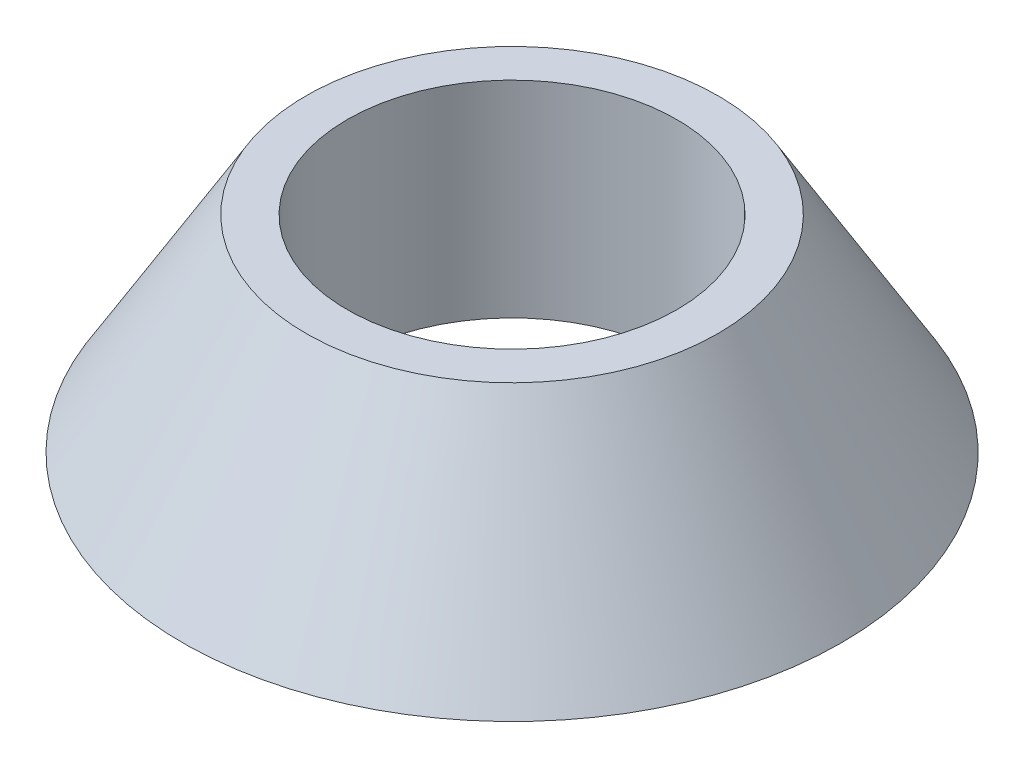
ISO-10303-21;
HEADER;
FILE_DESCRIPTION(('STEP AP214'),'2;1');
FILE_NAME('part.step','',(''),(''),'','','');
FILE_SCHEMA(('AUTOMOTIVE_DESIGN { 1 0 10303 214 1 1 1 1 }'));
ENDSEC;
DATA;
#1=APPLICATION_CONTEXT('core data for automotive mechanical design processes');
#2=APPLICATION_PROTOCOL_DEFINITION('international standard','automotive_design',2000,#1);
#3=PRODUCT_CONTEXT('',#1,'mechanical');
#4=PRODUCT('Part','Part','',(#3));
#5=PRODUCT_RELATED_PRODUCT_CATEGORY('part','',(#4));
#6=PRODUCT_DEFINITION_FORMATION('','',#4);
#7=PRODUCT_DEFINITION_CONTEXT('part definition',#1,'design');
#8=PRODUCT_DEFINITION('design','',#6,#7);
#9=PRODUCT_DEFINITION_SHAPE('','',#8);
#10=(LENGTH_UNIT() NAMED_UNIT(*) SI_UNIT(.MILLI.,.METRE.));
#11=(NAMED_UNIT(*) PLANE_ANGLE_UNIT() SI_UNIT($,.RADIAN.));
#12=(NAMED_UNIT(*) SI_UNIT($,.STERADIAN.) SOLID_ANGLE_UNIT());
#13=UNCERTAINTY_MEASURE_WITH_UNIT(LENGTH_MEASURE(1.E-05),#10,'distance_accuracy_value','');
#14=(GEOMETRIC_REPRESENTATION_CONTEXT(3) GLOBAL_UNCERTAINTY_ASSIGNED_CONTEXT((#13)) GLOBAL_UNIT_ASSIGNED_CONTEXT((#10,
#11,#12)) REPRESENTATION_CONTEXT('',''));
#15=CARTESIAN_POINT('',(0.,0.,0.));
#16=DIRECTION('',(0.,0.,1.));
#17=DIRECTION('',(1.,0.,0.));
#18=AXIS2_PLACEMENT_3D('',#15,#16,#17);
#19=CARTESIAN_POINT('',(8.,0.,0.));
#20=DIRECTION('',(0.,-1.,0.));
#21=DIRECTION('',(1.,0.,0.));
#22=AXIS2_PLACEMENT_3D('',#19,#20,#21);
#23=PLANE('',#22);
#24=CARTESIAN_POINT('',(0.,0.,0.));
#25=DIRECTION('',(0.,1.,0.));
#26=DIRECTION('',(1.,0.,0.));
#27=AXIS2_PLACEMENT_3D('',#24,#25,#26);
#28=CIRCLE('',#27,8.);
#29=CARTESIAN_POINT('',(8.,0.,0.));
#30=VERTEX_POINT('',#29);
#31=EDGE_CURVE('E49',#30,#30,#28,.T.);
#32=ORIENTED_EDGE('',*,*,#31,.F.);
#33=EDGE_LOOP('',(#32));
#34=FACE_BOUND('',#33,.T.);
#35=CARTESIAN_POINT('',(0.,0.,0.));
#36=DIRECTION('',(0.,1.,0.));
#37=DIRECTION('',(1.,0.,0.));
#38=AXIS2_PLACEMENT_3D('',#35,#36,#37);
#39=CIRCLE('',#38,4.);
#40=CARTESIAN_POINT('',(4.,0.,0.));
#41=VERTEX_POINT('',#40);
#42=EDGE_CURVE('E10',#41,#41,#39,.T.);
#43=ORIENTED_EDGE('',*,*,#42,.T.);
#44=EDGE_LOOP('',(#43));
#45=FACE_BOUND('',#44,.T.);
#46=ADVANCED_FACE('F35',(#34,#45),#23,.T.);
#47=CARTESIAN_POINT('',(0.,0.,0.));
#48=DIRECTION('',(0.,-1.,0.));
#49=DIRECTION('',(1.,0.,0.));
#50=AXIS2_PLACEMENT_3D('',#47,#48,#49);
#51=CYLINDRICAL_SURFACE('',#50,4.00000000000001);
#52=ORIENTED_EDGE('',*,*,#42,.F.);
#53=EDGE_LOOP('',(#52));
#54=FACE_BOUND('',#53,.T.);
#55=CARTESIAN_POINT('',(0.,4.99999999999999,0.));
#56=DIRECTION('',(0.,1.,0.));
#57=DIRECTION('',(1.,0.,0.));
#58=AXIS2_PLACEMENT_3D('',#55,#56,#57);
#59=CIRCLE('',#58,4.00000000000002);
#60=CARTESIAN_POINT('',(4.,5.,0.));
#61=VERTEX_POINT('',#60);
#62=EDGE_CURVE('E41',#61,#61,#59,.T.);
#63=ORIENTED_EDGE('',*,*,#62,.T.);
#64=EDGE_LOOP('',(#63));
#65=FACE_BOUND('',#64,.T.);
#66=ADVANCED_FACE('F58',(#54,#65),#51,.F.);
#67=CARTESIAN_POINT('',(4.,5.,0.));
#68=DIRECTION('',(0.,1.,0.));
#69=DIRECTION('',(-1.,0.,0.));
#70=AXIS2_PLACEMENT_3D('',#67,#68,#69);
#71=PLANE('',#70);
#72=ORIENTED_EDGE('',*,*,#62,.F.);
#73=EDGE_LOOP('',(#72));
#74=FACE_BOUND('',#73,.T.);
#75=CARTESIAN_POINT('',(0.,4.99999999999998,0.));
#76=DIRECTION('',(0.,1.,0.));
#77=DIRECTION('',(1.,0.,0.));
#78=AXIS2_PLACEMENT_3D('',#75,#76,#77);
#79=CIRCLE('',#78,5.00000000000002);
#80=CARTESIAN_POINT('',(5.,5.,0.));
#81=VERTEX_POINT('',#80);
#82=EDGE_CURVE('E45',#81,#81,#79,.T.);
#83=ORIENTED_EDGE('',*,*,#82,.T.);
#84=EDGE_LOOP('',(#83));
#85=FACE_BOUND('',#84,.T.);
#86=ADVANCED_FACE('F62',(#74,#85),#71,.T.);
#87=CARTESIAN_POINT('',(0.,0.,0.));
#88=DIRECTION('',(0.,-1.,0.));
#89=DIRECTION('',(1.,0.,0.));
#90=AXIS2_PLACEMENT_3D('',#87,#88,#89);
#91=CONICAL_SURFACE('',#90,8.,0.540419500270581);
#92=ORIENTED_EDGE('',*,*,#82,.F.);
#93=EDGE_LOOP('',(#92));
#94=FACE_BOUND('',#93,.T.);
#95=ORIENTED_EDGE('',*,*,#31,.T.);
#96=EDGE_LOOP('',(#95));
#97=FACE_BOUND('',#96,.T.);
#98=ADVANCED_FACE('F55',(#94,#97),#91,.T.);
#99=CLOSED_SHELL('',(#46,#66,#86,#98));
#100=MANIFOLD_SOLID_BREP('B2',#99);
#101=ADVANCED_BREP_SHAPE_REPRESENTATION('',(#18,#100),#14);
#102=SHAPE_DEFINITION_REPRESENTATION(#9,#101);
ENDSEC;
END-ISO-10303-21;
